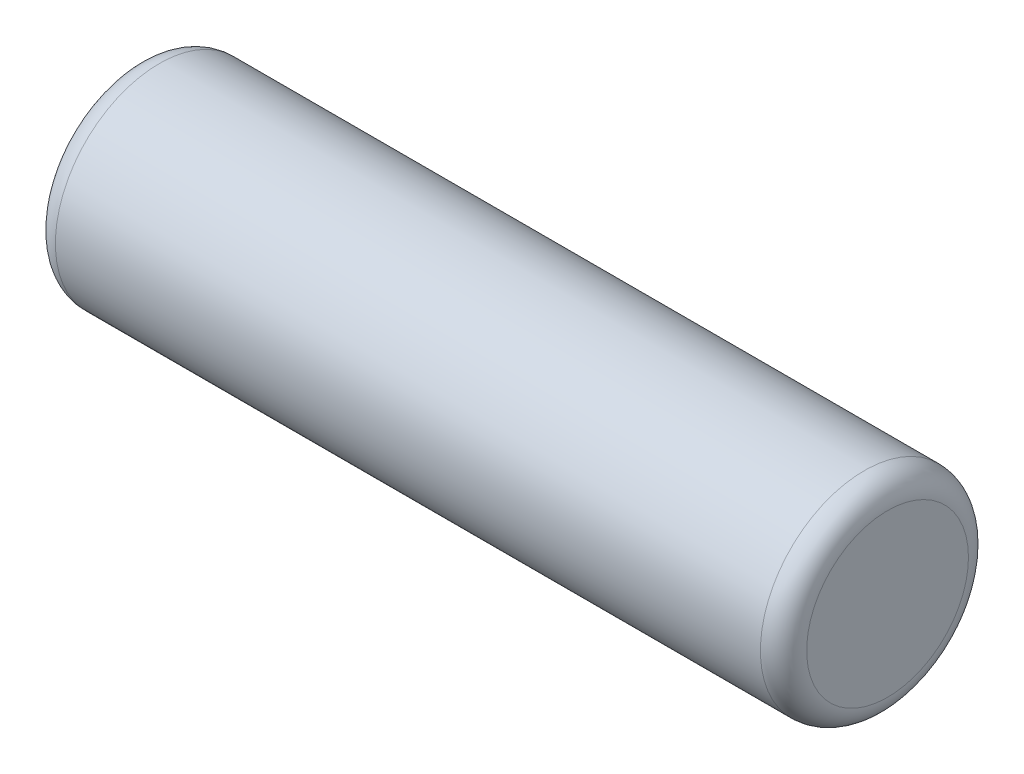
ISO-10303-21;
HEADER;
FILE_DESCRIPTION(('STEP AP214'),'2;1');
FILE_NAME('part.step','',(''),(''),'','','');
FILE_SCHEMA(('AUTOMOTIVE_DESIGN { 1 0 10303 214 1 1 1 1 }'));
ENDSEC;
DATA;
#1=APPLICATION_CONTEXT('core data for automotive mechanical design processes');
#2=APPLICATION_PROTOCOL_DEFINITION('international standard','automotive_design',2000,#1);
#3=PRODUCT_CONTEXT('',#1,'mechanical');
#4=PRODUCT('Part','Part','',(#3));
#5=PRODUCT_RELATED_PRODUCT_CATEGORY('part','',(#4));
#6=PRODUCT_DEFINITION_FORMATION('','',#4);
#7=PRODUCT_DEFINITION_CONTEXT('part definition',#1,'design');
#8=PRODUCT_DEFINITION('design','',#6,#7);
#9=PRODUCT_DEFINITION_SHAPE('','',#8);
#10=(LENGTH_UNIT() NAMED_UNIT(*) SI_UNIT(.MILLI.,.METRE.));
#11=(NAMED_UNIT(*) PLANE_ANGLE_UNIT() SI_UNIT($,.RADIAN.));
#12=(NAMED_UNIT(*) SI_UNIT($,.STERADIAN.) SOLID_ANGLE_UNIT());
#13=UNCERTAINTY_MEASURE_WITH_UNIT(LENGTH_MEASURE(1.E-05),#10,'distance_accuracy_value','');
#14=(GEOMETRIC_REPRESENTATION_CONTEXT(3) GLOBAL_UNCERTAINTY_ASSIGNED_CONTEXT((#13)) GLOBAL_UNIT_ASSIGNED_CONTEXT((#10,
#11,#12)) REPRESENTATION_CONTEXT('',''));
#15=CARTESIAN_POINT('',(0.,0.,0.));
#16=DIRECTION('',(0.,0.,1.));
#17=DIRECTION('',(1.,0.,0.));
#18=AXIS2_PLACEMENT_3D('',#15,#16,#17);
#19=CARTESIAN_POINT('',(32.5,0.,0.));
#20=DIRECTION('',(-1.,0.,0.));
#21=DIRECTION('',(0.,0.,1.));
#22=AXIS2_PLACEMENT_3D('',#19,#20,#21);
#23=CYLINDRICAL_SURFACE('',#22,9.);
#24=CARTESIAN_POINT('',(-30.5,0.,0.));
#25=DIRECTION('',(1.,0.,0.));
#26=DIRECTION('',(0.,0.,-1.));
#27=AXIS2_PLACEMENT_3D('',#24,#25,#26);
#28=CIRCLE('',#27,9.);
#29=CARTESIAN_POINT('',(-30.5,0.,-9.));
#30=VERTEX_POINT('',#29);
#31=EDGE_CURVE('E49',#30,#30,#28,.T.);
#32=ORIENTED_EDGE('',*,*,#31,.T.);
#33=EDGE_LOOP('',(#32));
#34=FACE_BOUND('',#33,.T.);
#35=CARTESIAN_POINT('',(30.5,0.,0.));
#36=DIRECTION('',(1.,0.,0.));
#37=DIRECTION('',(0.,0.,-1.));
#38=AXIS2_PLACEMENT_3D('',#35,#36,#37);
#39=CIRCLE('',#38,9.);
#40=CARTESIAN_POINT('',(30.5,0.,-9.));
#41=VERTEX_POINT('',#40);
#42=EDGE_CURVE('E53',#41,#41,#39,.F.);
#43=ORIENTED_EDGE('',*,*,#42,.T.);
#44=EDGE_LOOP('',(#43));
#45=FACE_BOUND('',#44,.T.);
#46=ADVANCED_FACE('F38',(#34,#45),#23,.T.);
#47=CARTESIAN_POINT('',(32.5,0.,0.));
#48=DIRECTION('',(1.,0.,0.));
#49=DIRECTION('',(0.,0.,-1.));
#50=AXIS2_PLACEMENT_3D('',#47,#48,#49);
#51=PLANE('',#50);
#52=CARTESIAN_POINT('',(32.5,0.,0.));
#53=DIRECTION('',(1.,0.,0.));
#54=DIRECTION('',(0.,0.,-1.));
#55=AXIS2_PLACEMENT_3D('',#52,#53,#54);
#56=CIRCLE('',#55,7.);
#57=CARTESIAN_POINT('',(32.5,0.,-7.));
#58=VERTEX_POINT('',#57);
#59=EDGE_CURVE('E10',#58,#58,#56,.T.);
#60=ORIENTED_EDGE('',*,*,#59,.T.);
#61=EDGE_LOOP('',(#60));
#62=FACE_BOUND('',#61,.T.);
#63=ADVANCED_FACE('F69',(#62),#51,.T.);
#64=CARTESIAN_POINT('',(-32.5,0.,0.));
#65=DIRECTION('',(1.,0.,0.));
#66=DIRECTION('',(0.,0.,-1.));
#67=AXIS2_PLACEMENT_3D('',#64,#65,#66);
#68=PLANE('',#67);
#69=CARTESIAN_POINT('',(-32.5,0.,0.));
#70=DIRECTION('',(1.,0.,0.));
#71=DIRECTION('',(0.,0.,-1.));
#72=AXIS2_PLACEMENT_3D('',#69,#70,#71);
#73=CIRCLE('',#72,7.);
#74=CARTESIAN_POINT('',(-32.5,0.,-7.));
#75=VERTEX_POINT('',#74);
#76=EDGE_CURVE('E45',#75,#75,#73,.F.);
#77=ORIENTED_EDGE('',*,*,#76,.T.);
#78=EDGE_LOOP('',(#77));
#79=FACE_BOUND('',#78,.T.);
#80=ADVANCED_FACE('F66',(#79),#68,.F.);
#81=CARTESIAN_POINT('',(-30.5,0.,0.));
#82=DIRECTION('',(1.,0.,0.));
#83=DIRECTION('',(0.,0.,-1.));
#84=AXIS2_PLACEMENT_3D('',#81,#82,#83);
#85=TOROIDAL_SURFACE('',#84,7.,2.);
#86=ORIENTED_EDGE('',*,*,#76,.F.);
#87=EDGE_LOOP('',(#86));
#88=FACE_BOUND('',#87,.T.);
#89=ORIENTED_EDGE('',*,*,#31,.F.);
#90=EDGE_LOOP('',(#89));
#91=FACE_BOUND('',#90,.T.);
#92=ADVANCED_FACE('F62',(#88,#91),#85,.T.);
#93=CARTESIAN_POINT('',(30.5,0.,0.));
#94=DIRECTION('',(1.,0.,0.));
#95=DIRECTION('',(0.,0.,-1.));
#96=AXIS2_PLACEMENT_3D('',#93,#94,#95);
#97=TOROIDAL_SURFACE('',#96,7.,2.);
#98=ORIENTED_EDGE('',*,*,#42,.F.);
#99=EDGE_LOOP('',(#98));
#100=FACE_BOUND('',#99,.T.);
#101=ORIENTED_EDGE('',*,*,#59,.F.);
#102=EDGE_LOOP('',(#101));
#103=FACE_BOUND('',#102,.T.);
#104=ADVANCED_FACE('F40',(#100,#103),#97,.T.);
#105=CLOSED_SHELL('',(#46,#63,#80,#92,#104));
#106=MANIFOLD_SOLID_BREP('B2',#105);
#107=ADVANCED_BREP_SHAPE_REPRESENTATION('',(#18,#106),#14);
#108=SHAPE_DEFINITION_REPRESENTATION(#9,#107);
ENDSEC;
END-ISO-10303-21;
